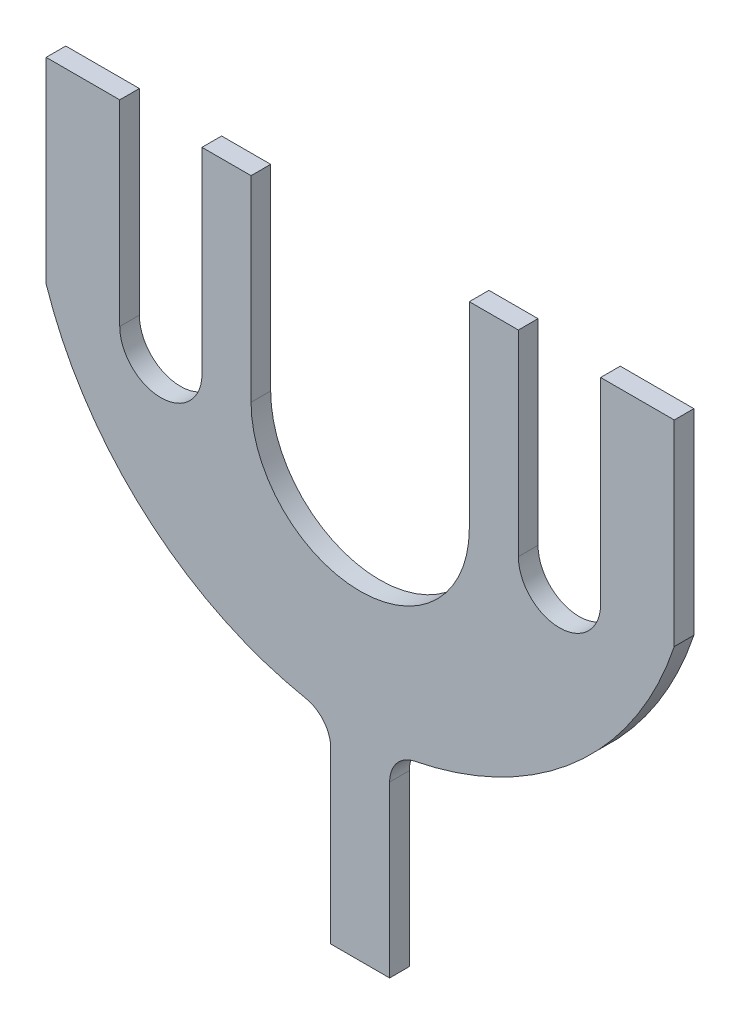
ISO-10303-21;
HEADER;
FILE_DESCRIPTION(('STEP AP214'),'2;1');
FILE_NAME('part.step','',(''),(''),'','','');
FILE_SCHEMA(('AUTOMOTIVE_DESIGN { 1 0 10303 214 1 1 1 1 }'));
ENDSEC;
DATA;
#1=APPLICATION_CONTEXT('core data for automotive mechanical design processes');
#2=APPLICATION_PROTOCOL_DEFINITION('international standard','automotive_design',2000,#1);
#3=PRODUCT_CONTEXT('',#1,'mechanical');
#4=PRODUCT('Part','Part','',(#3));
#5=PRODUCT_RELATED_PRODUCT_CATEGORY('part','',(#4));
#6=PRODUCT_DEFINITION_FORMATION('','',#4);
#7=PRODUCT_DEFINITION_CONTEXT('part definition',#1,'design');
#8=PRODUCT_DEFINITION('design','',#6,#7);
#9=PRODUCT_DEFINITION_SHAPE('','',#8);
#10=(LENGTH_UNIT() NAMED_UNIT(*) SI_UNIT(.MILLI.,.METRE.));
#11=(NAMED_UNIT(*) PLANE_ANGLE_UNIT() SI_UNIT($,.RADIAN.));
#12=(NAMED_UNIT(*) SI_UNIT($,.STERADIAN.) SOLID_ANGLE_UNIT());
#13=UNCERTAINTY_MEASURE_WITH_UNIT(LENGTH_MEASURE(1.E-05),#10,'distance_accuracy_value','');
#14=(GEOMETRIC_REPRESENTATION_CONTEXT(3) GLOBAL_UNCERTAINTY_ASSIGNED_CONTEXT((#13)) GLOBAL_UNIT_ASSIGNED_CONTEXT((#10,
#11,#12)) REPRESENTATION_CONTEXT('',''));
#15=CARTESIAN_POINT('',(0.,0.,0.));
#16=DIRECTION('',(0.,0.,1.));
#17=DIRECTION('',(1.,0.,0.));
#18=AXIS2_PLACEMENT_3D('',#15,#16,#17);
#19=CARTESIAN_POINT('',(-4.99999999999998,11.4877700189129,1.));
#20=DIRECTION('',(0.,0.,-1.));
#21=DIRECTION('',(-1.,0.,0.));
#22=AXIS2_PLACEMENT_3D('',#19,#20,#21);
#23=CYLINDRICAL_SURFACE('',#22,5.56);
#24=CARTESIAN_POINT('',(-4.99999999999998,11.4877700189129,0.));
#25=DIRECTION('',(0.,0.,-1.));
#26=DIRECTION('',(1.,0.,0.));
#27=AXIS2_PLACEMENT_3D('',#24,#25,#26);
#28=CIRCLE('',#27,5.56);
#29=CARTESIAN_POINT('',(0.560000000000015,11.4877700189129,0.));
#30=VERTEX_POINT('',#29);
#31=CARTESIAN_POINT('',(-10.56,11.4877700189129,0.));
#32=VERTEX_POINT('',#31);
#33=EDGE_CURVE('E227',#30,#32,#28,.T.);
#34=ORIENTED_EDGE('',*,*,#33,.T.);
#35=DIRECTION('',(0.,0.,-1.));
#36=VECTOR('',#35,1.);
#37=CARTESIAN_POINT('',(-10.56,11.4877700189129,1.));
#38=LINE('',#37,#36);
#39=CARTESIAN_POINT('',(-10.56,11.4877700189129,1.));
#40=VERTEX_POINT('',#39);
#41=EDGE_CURVE('E11',#40,#32,#38,.T.);
#42=ORIENTED_EDGE('',*,*,#41,.F.);
#43=CARTESIAN_POINT('',(-4.99999999999998,11.4877700189129,1.));
#44=DIRECTION('',(0.,0.,-1.));
#45=DIRECTION('',(1.,0.,0.));
#46=AXIS2_PLACEMENT_3D('',#43,#44,#45);
#47=CIRCLE('',#46,5.56);
#48=CARTESIAN_POINT('',(0.560000000000015,11.4877700189129,1.));
#49=VERTEX_POINT('',#48);
#50=EDGE_CURVE('E290',#49,#40,#47,.T.);
#51=ORIENTED_EDGE('',*,*,#50,.F.);
#52=DIRECTION('',(0.,0.,-1.));
#53=VECTOR('',#52,1.);
#54=CARTESIAN_POINT('',(0.560000000000015,11.4877700189129,1.));
#55=LINE('',#54,#53);
#56=EDGE_CURVE('E223',#49,#30,#55,.T.);
#57=ORIENTED_EDGE('',*,*,#56,.T.);
#58=EDGE_LOOP('',(#34,#42,#51,#57));
#59=FACE_BOUND('',#58,.T.);
#60=ADVANCED_FACE('F40',(#59),#23,.F.);
#61=CARTESIAN_POINT('',(-10.56,21.4877700189129,1.));
#62=DIRECTION('',(-1.,0.,0.));
#63=DIRECTION('',(0.,-1.,0.));
#64=AXIS2_PLACEMENT_3D('',#61,#62,#63);
#65=PLANE('',#64);
#66=DIRECTION('',(0.,1.,0.));
#67=VECTOR('',#66,1.);
#68=CARTESIAN_POINT('',(-10.56,21.4877700189129,0.));
#69=LINE('',#68,#67);
#70=CARTESIAN_POINT('',(-10.56,21.4877700189129,0.));
#71=VERTEX_POINT('',#70);
#72=EDGE_CURVE('E230',#32,#71,#69,.T.);
#73=ORIENTED_EDGE('',*,*,#72,.T.);
#74=DIRECTION('',(0.,0.,-1.));
#75=VECTOR('',#74,1.);
#76=CARTESIAN_POINT('',(-10.56,21.4877700189129,1.));
#77=LINE('',#76,#75);
#78=CARTESIAN_POINT('',(-10.56,21.4877700189129,1.));
#79=VERTEX_POINT('',#78);
#80=EDGE_CURVE('E49',#79,#71,#77,.T.);
#81=ORIENTED_EDGE('',*,*,#80,.F.);
#82=DIRECTION('',(0.,1.,0.));
#83=VECTOR('',#82,1.);
#84=CARTESIAN_POINT('',(-10.56,21.4877700189129,1.));
#85=LINE('',#84,#83);
#86=EDGE_CURVE('E142',#40,#79,#85,.T.);
#87=ORIENTED_EDGE('',*,*,#86,.F.);
#88=ORIENTED_EDGE('',*,*,#41,.T.);
#89=EDGE_LOOP('',(#73,#81,#87,#88));
#90=FACE_BOUND('',#89,.T.);
#91=ADVANCED_FACE('F437',(#90),#65,.F.);
#92=CARTESIAN_POINT('',(-13.06,21.4877700189129,1.));
#93=DIRECTION('',(0.,-1.,0.));
#94=DIRECTION('',(0.,0.,-1.));
#95=AXIS2_PLACEMENT_3D('',#92,#93,#94);
#96=PLANE('',#95);
#97=DIRECTION('',(-1.,0.,0.));
#98=VECTOR('',#97,1.);
#99=CARTESIAN_POINT('',(-13.06,21.4877700189129,0.));
#100=LINE('',#99,#98);
#101=CARTESIAN_POINT('',(-13.06,21.4877700189129,0.));
#102=VERTEX_POINT('',#101);
#103=EDGE_CURVE('E233',#71,#102,#100,.T.);
#104=ORIENTED_EDGE('',*,*,#103,.T.);
#105=DIRECTION('',(0.,0.,-1.));
#106=VECTOR('',#105,1.);
#107=CARTESIAN_POINT('',(-13.06,21.4877700189129,1.));
#108=LINE('',#107,#106);
#109=CARTESIAN_POINT('',(-13.06,21.4877700189129,1.));
#110=VERTEX_POINT('',#109);
#111=EDGE_CURVE('E357',#110,#102,#108,.T.);
#112=ORIENTED_EDGE('',*,*,#111,.F.);
#113=DIRECTION('',(-1.,0.,0.));
#114=VECTOR('',#113,1.);
#115=CARTESIAN_POINT('',(-13.06,21.4877700189129,1.));
#116=LINE('',#115,#114);
#117=EDGE_CURVE('E367',#79,#110,#116,.T.);
#118=ORIENTED_EDGE('',*,*,#117,.F.);
#119=ORIENTED_EDGE('',*,*,#80,.T.);
#120=EDGE_LOOP('',(#104,#112,#118,#119));
#121=FACE_BOUND('',#120,.T.);
#122=ADVANCED_FACE('F365',(#121),#96,.F.);
#123=CARTESIAN_POINT('',(-13.06,11.4877700189129,1.));
#124=DIRECTION('',(1.,0.,0.));
#125=DIRECTION('',(0.,0.,-1.));
#126=AXIS2_PLACEMENT_3D('',#123,#124,#125);
#127=PLANE('',#126);
#128=DIRECTION('',(0.,-1.,0.));
#129=VECTOR('',#128,1.);
#130=CARTESIAN_POINT('',(-13.06,11.4877700189129,0.));
#131=LINE('',#130,#129);
#132=CARTESIAN_POINT('',(-13.06,11.4877700189129,0.));
#133=VERTEX_POINT('',#132);
#134=EDGE_CURVE('E236',#102,#133,#131,.T.);
#135=ORIENTED_EDGE('',*,*,#134,.T.);
#136=DIRECTION('',(0.,0.,-1.));
#137=VECTOR('',#136,1.);
#138=CARTESIAN_POINT('',(-13.06,11.4877700189129,1.));
#139=LINE('',#138,#137);
#140=CARTESIAN_POINT('',(-13.06,11.4877700189129,1.));
#141=VERTEX_POINT('',#140);
#142=EDGE_CURVE('E353',#141,#133,#139,.T.);
#143=ORIENTED_EDGE('',*,*,#142,.F.);
#144=DIRECTION('',(0.,-1.,0.));
#145=VECTOR('',#144,1.);
#146=CARTESIAN_POINT('',(-13.06,11.4877700189129,1.));
#147=LINE('',#146,#145);
#148=EDGE_CURVE('E386',#110,#141,#147,.T.);
#149=ORIENTED_EDGE('',*,*,#148,.F.);
#150=ORIENTED_EDGE('',*,*,#111,.T.);
#151=EDGE_LOOP('',(#135,#143,#149,#150));
#152=FACE_BOUND('',#151,.T.);
#153=ADVANCED_FACE('F376',(#152),#127,.F.);
#154=CARTESIAN_POINT('',(-15.155,11.4877700189129,1.));
#155=DIRECTION('',(0.,0.,-1.));
#156=DIRECTION('',(-1.,0.,0.));
#157=AXIS2_PLACEMENT_3D('',#154,#155,#156);
#158=CYLINDRICAL_SURFACE('',#157,2.095);
#159=CARTESIAN_POINT('',(-15.155,11.4877700189129,0.));
#160=DIRECTION('',(0.,0.,-1.));
#161=DIRECTION('',(1.,0.,0.));
#162=AXIS2_PLACEMENT_3D('',#159,#160,#161);
#163=CIRCLE('',#162,2.095);
#164=CARTESIAN_POINT('',(-17.25,11.4877700189129,0.));
#165=VERTEX_POINT('',#164);
#166=EDGE_CURVE('E239',#133,#165,#163,.T.);
#167=ORIENTED_EDGE('',*,*,#166,.T.);
#168=DIRECTION('',(0.,0.,-1.));
#169=VECTOR('',#168,1.);
#170=CARTESIAN_POINT('',(-17.25,11.4877700189129,1.));
#171=LINE('',#170,#169);
#172=CARTESIAN_POINT('',(-17.25,11.4877700189129,1.));
#173=VERTEX_POINT('',#172);
#174=EDGE_CURVE('E349',#173,#165,#171,.T.);
#175=ORIENTED_EDGE('',*,*,#174,.F.);
#176=CARTESIAN_POINT('',(-15.155,11.4877700189129,1.));
#177=DIRECTION('',(0.,0.,-1.));
#178=DIRECTION('',(1.,0.,0.));
#179=AXIS2_PLACEMENT_3D('',#176,#177,#178);
#180=CIRCLE('',#179,2.095);
#181=EDGE_CURVE('E382',#141,#173,#180,.T.);
#182=ORIENTED_EDGE('',*,*,#181,.F.);
#183=ORIENTED_EDGE('',*,*,#142,.T.);
#184=EDGE_LOOP('',(#167,#175,#182,#183));
#185=FACE_BOUND('',#184,.T.);
#186=ADVANCED_FACE('F380',(#185),#158,.F.);
#187=CARTESIAN_POINT('',(-17.25,11.4877700189129,1.));
#188=DIRECTION('',(-1.,0.,0.));
#189=DIRECTION('',(0.,0.,1.));
#190=AXIS2_PLACEMENT_3D('',#187,#188,#189);
#191=PLANE('',#190);
#192=DIRECTION('',(0.,1.,0.));
#193=VECTOR('',#192,1.);
#194=CARTESIAN_POINT('',(-17.25,11.4877700189129,0.));
#195=LINE('',#194,#193);
#196=CARTESIAN_POINT('',(-17.25,21.4877700189129,0.));
#197=VERTEX_POINT('',#196);
#198=EDGE_CURVE('E242',#165,#197,#195,.T.);
#199=ORIENTED_EDGE('',*,*,#198,.T.);
#200=DIRECTION('',(0.,0.,-1.));
#201=VECTOR('',#200,1.);
#202=CARTESIAN_POINT('',(-17.25,21.4877700189129,1.));
#203=LINE('',#202,#201);
#204=CARTESIAN_POINT('',(-17.25,21.4877700189129,1.));
#205=VERTEX_POINT('',#204);
#206=EDGE_CURVE('E345',#205,#197,#203,.T.);
#207=ORIENTED_EDGE('',*,*,#206,.F.);
#208=DIRECTION('',(0.,1.,0.));
#209=VECTOR('',#208,1.);
#210=CARTESIAN_POINT('',(-17.25,11.4877700189129,1.));
#211=LINE('',#210,#209);
#212=EDGE_CURVE('E385',#173,#205,#211,.T.);
#213=ORIENTED_EDGE('',*,*,#212,.F.);
#214=ORIENTED_EDGE('',*,*,#174,.T.);
#215=EDGE_LOOP('',(#199,#207,#213,#214));
#216=FACE_BOUND('',#215,.T.);
#217=ADVANCED_FACE('F449',(#216),#191,.F.);
#218=CARTESIAN_POINT('',(-21.,21.4877700189129,1.));
#219=DIRECTION('',(0.,-1.,0.));
#220=DIRECTION('',(1.,0.,0.));
#221=AXIS2_PLACEMENT_3D('',#218,#219,#220);
#222=PLANE('',#221);
#223=DIRECTION('',(-1.,0.,0.));
#224=VECTOR('',#223,1.);
#225=CARTESIAN_POINT('',(-21.,21.4877700189129,0.));
#226=LINE('',#225,#224);
#227=CARTESIAN_POINT('',(-21.,21.4877700189129,0.));
#228=VERTEX_POINT('',#227);
#229=EDGE_CURVE('E245',#197,#228,#226,.T.);
#230=ORIENTED_EDGE('',*,*,#229,.T.);
#231=DIRECTION('',(0.,0.,-1.));
#232=VECTOR('',#231,1.);
#233=CARTESIAN_POINT('',(-21.,21.4877700189129,1.));
#234=LINE('',#233,#232);
#235=CARTESIAN_POINT('',(-21.,21.4877700189129,1.));
#236=VERTEX_POINT('',#235);
#237=EDGE_CURVE('E341',#236,#228,#234,.T.);
#238=ORIENTED_EDGE('',*,*,#237,.F.);
#239=DIRECTION('',(-1.,0.,0.));
#240=VECTOR('',#239,1.);
#241=CARTESIAN_POINT('',(-21.,21.4877700189129,1.));
#242=LINE('',#241,#240);
#243=EDGE_CURVE('E389',#205,#236,#242,.T.);
#244=ORIENTED_EDGE('',*,*,#243,.F.);
#245=ORIENTED_EDGE('',*,*,#206,.T.);
#246=EDGE_LOOP('',(#230,#238,#244,#245));
#247=FACE_BOUND('',#246,.T.);
#248=ADVANCED_FACE('F452',(#247),#222,.F.);
#249=CARTESIAN_POINT('',(-21.,21.4877700189129,1.));
#250=DIRECTION('',(1.,0.,0.));
#251=DIRECTION('',(0.,0.,-1.));
#252=AXIS2_PLACEMENT_3D('',#249,#250,#251);
#253=PLANE('',#252);
#254=DIRECTION('',(0.,-1.,0.));
#255=VECTOR('',#254,1.);
#256=CARTESIAN_POINT('',(-21.,21.4877700189129,0.));
#257=LINE('',#256,#255);
#258=CARTESIAN_POINT('',(-21.,11.4877700189129,0.));
#259=VERTEX_POINT('',#258);
#260=EDGE_CURVE('E248',#228,#259,#257,.T.);
#261=ORIENTED_EDGE('',*,*,#260,.T.);
#262=DIRECTION('',(0.,0.,-1.));
#263=VECTOR('',#262,1.);
#264=CARTESIAN_POINT('',(-21.,11.4877700189129,1.));
#265=LINE('',#264,#263);
#266=CARTESIAN_POINT('',(-21.,11.4877700189129,1.));
#267=VERTEX_POINT('',#266);
#268=EDGE_CURVE('E337',#267,#259,#265,.T.);
#269=ORIENTED_EDGE('',*,*,#268,.F.);
#270=DIRECTION('',(0.,-1.,0.));
#271=VECTOR('',#270,1.);
#272=CARTESIAN_POINT('',(-21.,21.4877700189129,1.));
#273=LINE('',#272,#271);
#274=EDGE_CURVE('E396',#236,#267,#273,.T.);
#275=ORIENTED_EDGE('',*,*,#274,.F.);
#276=ORIENTED_EDGE('',*,*,#237,.T.);
#277=EDGE_LOOP('',(#261,#269,#275,#276));
#278=FACE_BOUND('',#277,.T.);
#279=ADVANCED_FACE('F456',(#278),#253,.F.);
#280=CARTESIAN_POINT('',(-4.38675227416383,16.9877700189129,1.));
#281=DIRECTION('',(0.,0.,-1.));
#282=DIRECTION('',(-1.,0.,0.));
#283=AXIS2_PLACEMENT_3D('',#280,#281,#282);
#284=CYLINDRICAL_SURFACE('',#283,17.5);
#285=CARTESIAN_POINT('',(-4.38675227416383,16.9877700189129,0.));
#286=DIRECTION('',(0.,0.,1.));
#287=DIRECTION('',(1.,0.,0.));
#288=AXIS2_PLACEMENT_3D('',#285,#286,#287);
#289=CIRCLE('',#288,17.5);
#290=CARTESIAN_POINT('',(-7.77971024153162,-0.18016043969734,0.));
#291=VERTEX_POINT('',#290);
#292=EDGE_CURVE('E251',#259,#291,#289,.T.);
#293=ORIENTED_EDGE('',*,*,#292,.T.);
#294=DIRECTION('',(0.,0.,-1.));
#295=VECTOR('',#294,1.);
#296=CARTESIAN_POINT('',(-7.77971024153162,-0.18016043969734,1.));
#297=LINE('',#296,#295);
#298=CARTESIAN_POINT('',(-7.77971024153162,-0.18016043969734,1.));
#299=VERTEX_POINT('',#298);
#300=EDGE_CURVE('E333',#299,#291,#297,.T.);
#301=ORIENTED_EDGE('',*,*,#300,.F.);
#302=CARTESIAN_POINT('',(-4.38675227416383,16.9877700189129,1.));
#303=DIRECTION('',(0.,0.,1.));
#304=DIRECTION('',(1.,0.,0.));
#305=AXIS2_PLACEMENT_3D('',#302,#303,#304);
#306=CIRCLE('',#305,17.5);
#307=EDGE_CURVE('E399',#267,#299,#306,.T.);
#308=ORIENTED_EDGE('',*,*,#307,.F.);
#309=ORIENTED_EDGE('',*,*,#268,.T.);
#310=EDGE_LOOP('',(#293,#301,#308,#309));
#311=FACE_BOUND('',#310,.T.);
#312=ADVANCED_FACE('F460',(#311),#284,.T.);
#313=CARTESIAN_POINT('',(-8.08749999999998,-1.73753698844269,1.));
#314=DIRECTION('',(0.,0.,-1.));
#315=DIRECTION('',(-1.,0.,0.));
#316=AXIS2_PLACEMENT_3D('',#313,#314,#315);
#317=CYLINDRICAL_SURFACE('',#316,1.5875);
#318=CARTESIAN_POINT('',(-8.08749999999998,-1.73753698844269,0.));
#319=DIRECTION('',(0.,0.,-1.));
#320=DIRECTION('',(-1.,0.,0.));
#321=AXIS2_PLACEMENT_3D('',#318,#319,#320);
#322=CIRCLE('',#321,1.5875);
#323=CARTESIAN_POINT('',(-6.49999999999998,-1.73753698844269,0.));
#324=VERTEX_POINT('',#323);
#325=EDGE_CURVE('E254',#291,#324,#322,.T.);
#326=ORIENTED_EDGE('',*,*,#325,.T.);
#327=DIRECTION('',(0.,0.,-1.));
#328=VECTOR('',#327,1.);
#329=CARTESIAN_POINT('',(-6.49999999999998,-1.73753698844269,1.));
#330=LINE('',#329,#328);
#331=CARTESIAN_POINT('',(-6.49999999999998,-1.73753698844269,1.));
#332=VERTEX_POINT('',#331);
#333=EDGE_CURVE('E329',#332,#324,#330,.T.);
#334=ORIENTED_EDGE('',*,*,#333,.F.);
#335=CARTESIAN_POINT('',(-8.08749999999998,-1.73753698844269,1.));
#336=DIRECTION('',(0.,0.,-1.));
#337=DIRECTION('',(-1.,0.,0.));
#338=AXIS2_PLACEMENT_3D('',#335,#336,#337);
#339=CIRCLE('',#338,1.5875);
#340=EDGE_CURVE('E402',#299,#332,#339,.T.);
#341=ORIENTED_EDGE('',*,*,#340,.F.);
#342=ORIENTED_EDGE('',*,*,#300,.T.);
#343=EDGE_LOOP('',(#326,#334,#341,#342));
#344=FACE_BOUND('',#343,.T.);
#345=ADVANCED_FACE('F464',(#344),#317,.F.);
#346=CARTESIAN_POINT('',(-6.49999999999998,-1.73753698844269,1.));
#347=DIRECTION('',(1.,0.,0.));
#348=DIRECTION('',(0.,1.,0.));
#349=AXIS2_PLACEMENT_3D('',#346,#347,#348);
#350=PLANE('',#349);
#351=DIRECTION('',(0.,-1.,0.));
#352=VECTOR('',#351,1.);
#353=CARTESIAN_POINT('',(-6.49999999999998,-1.73753698844269,0.));
#354=LINE('',#353,#352);
#355=CARTESIAN_POINT('',(-6.49999999999998,-10.3841666621037,0.));
#356=VERTEX_POINT('',#355);
#357=EDGE_CURVE('E257',#324,#356,#354,.T.);
#358=ORIENTED_EDGE('',*,*,#357,.T.);
#359=DIRECTION('',(0.,0.,-1.));
#360=VECTOR('',#359,1.);
#361=CARTESIAN_POINT('',(-6.49999999999998,-10.3841666621037,1.));
#362=LINE('',#361,#360);
#363=CARTESIAN_POINT('',(-6.49999999999998,-10.3841666621037,1.));
#364=VERTEX_POINT('',#363);
#365=EDGE_CURVE('E325',#364,#356,#362,.T.);
#366=ORIENTED_EDGE('',*,*,#365,.F.);
#367=DIRECTION('',(0.,-1.,0.));
#368=VECTOR('',#367,1.);
#369=CARTESIAN_POINT('',(-6.49999999999998,-1.73753698844269,1.));
#370=LINE('',#369,#368);
#371=EDGE_CURVE('E405',#332,#364,#370,.T.);
#372=ORIENTED_EDGE('',*,*,#371,.F.);
#373=ORIENTED_EDGE('',*,*,#333,.T.);
#374=EDGE_LOOP('',(#358,#366,#372,#373));
#375=FACE_BOUND('',#374,.T.);
#376=ADVANCED_FACE('F468',(#375),#350,.F.);
#377=CARTESIAN_POINT('',(-6.49999999999998,-10.3841666621037,1.));
#378=DIRECTION('',(0.,1.,0.));
#379=DIRECTION('',(0.,0.,1.));
#380=AXIS2_PLACEMENT_3D('',#377,#378,#379);
#381=PLANE('',#380);
#382=DIRECTION('',(1.,0.,0.));
#383=VECTOR('',#382,1.);
#384=CARTESIAN_POINT('',(-6.49999999999998,-10.3841666621037,0.));
#385=LINE('',#384,#383);
#386=CARTESIAN_POINT('',(-3.49999999999998,-10.3841666621037,0.));
#387=VERTEX_POINT('',#386);
#388=EDGE_CURVE('E260',#356,#387,#385,.T.);
#389=ORIENTED_EDGE('',*,*,#388,.T.);
#390=DIRECTION('',(0.,0.,-1.));
#391=VECTOR('',#390,1.);
#392=CARTESIAN_POINT('',(-3.49999999999998,-10.3841666621037,1.));
#393=LINE('',#392,#391);
#394=CARTESIAN_POINT('',(-3.49999999999998,-10.3841666621037,1.));
#395=VERTEX_POINT('',#394);
#396=EDGE_CURVE('E321',#395,#387,#393,.T.);
#397=ORIENTED_EDGE('',*,*,#396,.F.);
#398=DIRECTION('',(1.,0.,0.));
#399=VECTOR('',#398,1.);
#400=CARTESIAN_POINT('',(-6.49999999999998,-10.3841666621037,1.));
#401=LINE('',#400,#399);
#402=EDGE_CURVE('E408',#364,#395,#401,.T.);
#403=ORIENTED_EDGE('',*,*,#402,.F.);
#404=ORIENTED_EDGE('',*,*,#365,.T.);
#405=EDGE_LOOP('',(#389,#397,#403,#404));
#406=FACE_BOUND('',#405,.T.);
#407=ADVANCED_FACE('F472',(#406),#381,.F.);
#408=CARTESIAN_POINT('',(-3.49999999999998,-10.3841666621037,1.));
#409=DIRECTION('',(-1.,0.,0.));
#410=DIRECTION('',(0.,-1.,0.));
#411=AXIS2_PLACEMENT_3D('',#408,#409,#410);
#412=PLANE('',#411);
#413=DIRECTION('',(0.,1.,0.));
#414=VECTOR('',#413,1.);
#415=CARTESIAN_POINT('',(-3.49999999999998,-10.3841666621037,0.));
#416=LINE('',#415,#414);
#417=CARTESIAN_POINT('',(-3.49999999999998,-1.73753698844269,0.));
#418=VERTEX_POINT('',#417);
#419=EDGE_CURVE('E263',#387,#418,#416,.T.);
#420=ORIENTED_EDGE('',*,*,#419,.T.);
#421=DIRECTION('',(0.,0.,-1.));
#422=VECTOR('',#421,1.);
#423=CARTESIAN_POINT('',(-3.49999999999998,-1.73753698844269,1.));
#424=LINE('',#423,#422);
#425=CARTESIAN_POINT('',(-3.49999999999998,-1.73753698844269,1.));
#426=VERTEX_POINT('',#425);
#427=EDGE_CURVE('E317',#426,#418,#424,.T.);
#428=ORIENTED_EDGE('',*,*,#427,.F.);
#429=DIRECTION('',(0.,1.,0.));
#430=VECTOR('',#429,1.);
#431=CARTESIAN_POINT('',(-3.49999999999998,-10.3841666621037,1.));
#432=LINE('',#431,#430);
#433=EDGE_CURVE('E411',#395,#426,#432,.T.);
#434=ORIENTED_EDGE('',*,*,#433,.F.);
#435=ORIENTED_EDGE('',*,*,#396,.T.);
#436=EDGE_LOOP('',(#420,#428,#434,#435));
#437=FACE_BOUND('',#436,.T.);
#438=ADVANCED_FACE('F476',(#437),#412,.F.);
#439=CARTESIAN_POINT('',(-1.91249999999998,-1.73753698844269,1.));
#440=DIRECTION('',(0.,0.,-1.));
#441=DIRECTION('',(-1.,0.,0.));
#442=AXIS2_PLACEMENT_3D('',#439,#440,#441);
#443=CYLINDRICAL_SURFACE('',#442,1.5875);
#444=CARTESIAN_POINT('',(-1.91249999999998,-1.73753698844269,0.));
#445=DIRECTION('',(0.,0.,-1.));
#446=DIRECTION('',(1.,0.,0.));
#447=AXIS2_PLACEMENT_3D('',#444,#445,#446);
#448=CIRCLE('',#447,1.5875);
#449=CARTESIAN_POINT('',(-2.22028975846834,-0.180160439697338,0.));
#450=VERTEX_POINT('',#449);
#451=EDGE_CURVE('E266',#418,#450,#448,.T.);
#452=ORIENTED_EDGE('',*,*,#451,.T.);
#453=DIRECTION('',(0.,0.,-1.));
#454=VECTOR('',#453,1.);
#455=CARTESIAN_POINT('',(-2.22028975846834,-0.180160439697338,1.));
#456=LINE('',#455,#454);
#457=CARTESIAN_POINT('',(-2.22028975846834,-0.180160439697338,1.));
#458=VERTEX_POINT('',#457);
#459=EDGE_CURVE('E313',#458,#450,#456,.T.);
#460=ORIENTED_EDGE('',*,*,#459,.F.);
#461=CARTESIAN_POINT('',(-1.91249999999998,-1.73753698844269,1.));
#462=DIRECTION('',(0.,0.,-1.));
#463=DIRECTION('',(1.,0.,0.));
#464=AXIS2_PLACEMENT_3D('',#461,#462,#463);
#465=CIRCLE('',#464,1.5875);
#466=EDGE_CURVE('E414',#426,#458,#465,.T.);
#467=ORIENTED_EDGE('',*,*,#466,.F.);
#468=ORIENTED_EDGE('',*,*,#427,.T.);
#469=EDGE_LOOP('',(#452,#460,#467,#468));
#470=FACE_BOUND('',#469,.T.);
#471=ADVANCED_FACE('F480',(#470),#443,.F.);
#472=CARTESIAN_POINT('',(-5.61324772583614,16.9877700189129,1.));
#473=DIRECTION('',(0.,0.,-1.));
#474=DIRECTION('',(-1.,0.,0.));
#475=AXIS2_PLACEMENT_3D('',#472,#473,#474);
#476=CYLINDRICAL_SURFACE('',#475,17.5);
#477=CARTESIAN_POINT('',(-5.61324772583614,16.9877700189129,0.));
#478=DIRECTION('',(0.,0.,1.));
#479=DIRECTION('',(-1.,0.,0.));
#480=AXIS2_PLACEMENT_3D('',#477,#478,#479);
#481=CIRCLE('',#480,17.5);
#482=CARTESIAN_POINT('',(11.,11.4877700189129,0.));
#483=VERTEX_POINT('',#482);
#484=EDGE_CURVE('E269',#450,#483,#481,.T.);
#485=ORIENTED_EDGE('',*,*,#484,.T.);
#486=DIRECTION('',(0.,0.,-1.));
#487=VECTOR('',#486,1.);
#488=CARTESIAN_POINT('',(11.,11.4877700189129,1.));
#489=LINE('',#488,#487);
#490=CARTESIAN_POINT('',(11.,11.4877700189129,1.));
#491=VERTEX_POINT('',#490);
#492=EDGE_CURVE('E309',#491,#483,#489,.T.);
#493=ORIENTED_EDGE('',*,*,#492,.F.);
#494=CARTESIAN_POINT('',(-5.61324772583614,16.9877700189129,1.));
#495=DIRECTION('',(0.,0.,1.));
#496=DIRECTION('',(-1.,0.,0.));
#497=AXIS2_PLACEMENT_3D('',#494,#495,#496);
#498=CIRCLE('',#497,17.5);
#499=EDGE_CURVE('E417',#458,#491,#498,.T.);
#500=ORIENTED_EDGE('',*,*,#499,.F.);
#501=ORIENTED_EDGE('',*,*,#459,.T.);
#502=EDGE_LOOP('',(#485,#493,#500,#501));
#503=FACE_BOUND('',#502,.T.);
#504=ADVANCED_FACE('F484',(#503),#476,.T.);
#505=CARTESIAN_POINT('',(11.,11.4877700189129,1.));
#506=DIRECTION('',(-1.,0.,0.));
#507=DIRECTION('',(0.,-1.,0.));
#508=AXIS2_PLACEMENT_3D('',#505,#506,#507);
#509=PLANE('',#508);
#510=DIRECTION('',(0.,1.,0.));
#511=VECTOR('',#510,1.);
#512=CARTESIAN_POINT('',(11.,11.4877700189129,0.));
#513=LINE('',#512,#511);
#514=CARTESIAN_POINT('',(11.,21.4877700189129,0.));
#515=VERTEX_POINT('',#514);
#516=EDGE_CURVE('E272',#483,#515,#513,.T.);
#517=ORIENTED_EDGE('',*,*,#516,.T.);
#518=DIRECTION('',(0.,0.,-1.));
#519=VECTOR('',#518,1.);
#520=CARTESIAN_POINT('',(11.,21.4877700189129,1.));
#521=LINE('',#520,#519);
#522=CARTESIAN_POINT('',(11.,21.4877700189129,1.));
#523=VERTEX_POINT('',#522);
#524=EDGE_CURVE('E305',#523,#515,#521,.T.);
#525=ORIENTED_EDGE('',*,*,#524,.F.);
#526=DIRECTION('',(0.,1.,0.));
#527=VECTOR('',#526,1.);
#528=CARTESIAN_POINT('',(11.,11.4877700189129,1.));
#529=LINE('',#528,#527);
#530=EDGE_CURVE('E420',#491,#523,#529,.T.);
#531=ORIENTED_EDGE('',*,*,#530,.F.);
#532=ORIENTED_EDGE('',*,*,#492,.T.);
#533=EDGE_LOOP('',(#517,#525,#531,#532));
#534=FACE_BOUND('',#533,.T.);
#535=ADVANCED_FACE('F488',(#534),#509,.F.);
#536=CARTESIAN_POINT('',(7.25000000000002,21.4877700189129,1.));
#537=DIRECTION('',(0.,-1.,0.));
#538=DIRECTION('',(0.,0.,-1.));
#539=AXIS2_PLACEMENT_3D('',#536,#537,#538);
#540=PLANE('',#539);
#541=DIRECTION('',(-1.,0.,0.));
#542=VECTOR('',#541,1.);
#543=CARTESIAN_POINT('',(7.25000000000002,21.4877700189129,0.));
#544=LINE('',#543,#542);
#545=CARTESIAN_POINT('',(7.25000000000002,21.4877700189129,0.));
#546=VERTEX_POINT('',#545);
#547=EDGE_CURVE('E275',#515,#546,#544,.T.);
#548=ORIENTED_EDGE('',*,*,#547,.T.);
#549=DIRECTION('',(0.,0.,-1.));
#550=VECTOR('',#549,1.);
#551=CARTESIAN_POINT('',(7.25000000000002,21.4877700189129,1.));
#552=LINE('',#551,#550);
#553=CARTESIAN_POINT('',(7.25000000000002,21.4877700189129,1.));
#554=VERTEX_POINT('',#553);
#555=EDGE_CURVE('E301',#554,#546,#552,.T.);
#556=ORIENTED_EDGE('',*,*,#555,.F.);
#557=DIRECTION('',(-1.,0.,0.));
#558=VECTOR('',#557,1.);
#559=CARTESIAN_POINT('',(7.25000000000002,21.4877700189129,1.));
#560=LINE('',#559,#558);
#561=EDGE_CURVE('E423',#523,#554,#560,.T.);
#562=ORIENTED_EDGE('',*,*,#561,.F.);
#563=ORIENTED_EDGE('',*,*,#524,.T.);
#564=EDGE_LOOP('',(#548,#556,#562,#563));
#565=FACE_BOUND('',#564,.T.);
#566=ADVANCED_FACE('F492',(#565),#540,.F.);
#567=CARTESIAN_POINT('',(7.25000000000002,11.4877700189129,1.));
#568=DIRECTION('',(1.,0.,0.));
#569=DIRECTION('',(0.,0.,-1.));
#570=AXIS2_PLACEMENT_3D('',#567,#568,#569);
#571=PLANE('',#570);
#572=DIRECTION('',(0.,-1.,0.));
#573=VECTOR('',#572,1.);
#574=CARTESIAN_POINT('',(7.25000000000002,11.4877700189129,0.));
#575=LINE('',#574,#573);
#576=CARTESIAN_POINT('',(7.25000000000002,11.4877700189129,0.));
#577=VERTEX_POINT('',#576);
#578=EDGE_CURVE('E278',#546,#577,#575,.T.);
#579=ORIENTED_EDGE('',*,*,#578,.T.);
#580=DIRECTION('',(0.,0.,-1.));
#581=VECTOR('',#580,1.);
#582=CARTESIAN_POINT('',(7.25000000000002,11.4877700189129,1.));
#583=LINE('',#582,#581);
#584=CARTESIAN_POINT('',(7.25000000000002,11.4877700189129,1.));
#585=VERTEX_POINT('',#584);
#586=EDGE_CURVE('E297',#585,#577,#583,.T.);
#587=ORIENTED_EDGE('',*,*,#586,.F.);
#588=DIRECTION('',(0.,-1.,0.));
#589=VECTOR('',#588,1.);
#590=CARTESIAN_POINT('',(7.25000000000002,11.4877700189129,1.));
#591=LINE('',#590,#589);
#592=EDGE_CURVE('E426',#554,#585,#591,.T.);
#593=ORIENTED_EDGE('',*,*,#592,.F.);
#594=ORIENTED_EDGE('',*,*,#555,.T.);
#595=EDGE_LOOP('',(#579,#587,#593,#594));
#596=FACE_BOUND('',#595,.T.);
#597=ADVANCED_FACE('F496',(#596),#571,.F.);
#598=CARTESIAN_POINT('',(5.15500000000002,11.4877700189129,1.));
#599=DIRECTION('',(0.,0.,-1.));
#600=DIRECTION('',(-1.,0.,0.));
#601=AXIS2_PLACEMENT_3D('',#598,#599,#600);
#602=CYLINDRICAL_SURFACE('',#601,2.095);
#603=CARTESIAN_POINT('',(5.15500000000002,11.4877700189129,0.));
#604=DIRECTION('',(0.,0.,-1.));
#605=DIRECTION('',(1.,0.,0.));
#606=AXIS2_PLACEMENT_3D('',#603,#604,#605);
#607=CIRCLE('',#606,2.095);
#608=CARTESIAN_POINT('',(3.06000000000002,11.4877700189129,0.));
#609=VERTEX_POINT('',#608);
#610=EDGE_CURVE('E281',#577,#609,#607,.T.);
#611=ORIENTED_EDGE('',*,*,#610,.T.);
#612=DIRECTION('',(0.,0.,-1.));
#613=VECTOR('',#612,1.);
#614=CARTESIAN_POINT('',(3.06000000000002,11.4877700189129,1.));
#615=LINE('',#614,#613);
#616=CARTESIAN_POINT('',(3.06000000000002,11.4877700189129,1.));
#617=VERTEX_POINT('',#616);
#618=EDGE_CURVE('E214',#617,#609,#615,.T.);
#619=ORIENTED_EDGE('',*,*,#618,.F.);
#620=CARTESIAN_POINT('',(5.15500000000002,11.4877700189129,1.));
#621=DIRECTION('',(0.,0.,-1.));
#622=DIRECTION('',(1.,0.,0.));
#623=AXIS2_PLACEMENT_3D('',#620,#621,#622);
#624=CIRCLE('',#623,2.095);
#625=EDGE_CURVE('E203',#585,#617,#624,.T.);
#626=ORIENTED_EDGE('',*,*,#625,.F.);
#627=ORIENTED_EDGE('',*,*,#586,.T.);
#628=EDGE_LOOP('',(#611,#619,#626,#627));
#629=FACE_BOUND('',#628,.T.);
#630=ADVANCED_FACE('F500',(#629),#602,.F.);
#631=CARTESIAN_POINT('',(3.06000000000001,21.4877700189129,1.));
#632=DIRECTION('',(-1.,0.,0.));
#633=DIRECTION('',(0.,-1.,0.));
#634=AXIS2_PLACEMENT_3D('',#631,#632,#633);
#635=PLANE('',#634);
#636=DIRECTION('',(0.,1.,0.));
#637=VECTOR('',#636,1.);
#638=CARTESIAN_POINT('',(3.06000000000001,21.4877700189129,0.));
#639=LINE('',#638,#637);
#640=CARTESIAN_POINT('',(3.06000000000001,21.4877700189129,0.));
#641=VERTEX_POINT('',#640);
#642=EDGE_CURVE('E212',#609,#641,#639,.T.);
#643=ORIENTED_EDGE('',*,*,#642,.T.);
#644=DIRECTION('',(0.,0.,-1.));
#645=VECTOR('',#644,1.);
#646=CARTESIAN_POINT('',(3.06000000000001,21.4877700189129,1.));
#647=LINE('',#646,#645);
#648=CARTESIAN_POINT('',(3.06000000000001,21.4877700189129,1.));
#649=VERTEX_POINT('',#648);
#650=EDGE_CURVE('E209',#649,#641,#647,.T.);
#651=ORIENTED_EDGE('',*,*,#650,.F.);
#652=DIRECTION('',(0.,1.,0.));
#653=VECTOR('',#652,1.);
#654=CARTESIAN_POINT('',(3.06000000000001,21.4877700189129,1.));
#655=LINE('',#654,#653);
#656=EDGE_CURVE('E197',#617,#649,#655,.T.);
#657=ORIENTED_EDGE('',*,*,#656,.F.);
#658=ORIENTED_EDGE('',*,*,#618,.T.);
#659=EDGE_LOOP('',(#643,#651,#657,#658));
#660=FACE_BOUND('',#659,.T.);
#661=ADVANCED_FACE('F210',(#660),#635,.F.);
#662=CARTESIAN_POINT('',(3.06000000000001,21.4877700189129,1.));
#663=DIRECTION('',(0.,-1.,0.));
#664=DIRECTION('',(0.,0.,-1.));
#665=AXIS2_PLACEMENT_3D('',#662,#663,#664);
#666=PLANE('',#665);
#667=DIRECTION('',(-1.,0.,0.));
#668=VECTOR('',#667,1.);
#669=CARTESIAN_POINT('',(3.06000000000001,21.4877700189129,0.));
#670=LINE('',#669,#668);
#671=CARTESIAN_POINT('',(0.560000000000014,21.4877700189129,0.));
#672=VERTEX_POINT('',#671);
#673=EDGE_CURVE('E128',#641,#672,#670,.T.);
#674=ORIENTED_EDGE('',*,*,#673,.T.);
#675=DIRECTION('',(0.,0.,-1.));
#676=VECTOR('',#675,1.);
#677=CARTESIAN_POINT('',(0.560000000000014,21.4877700189129,1.));
#678=LINE('',#677,#676);
#679=CARTESIAN_POINT('',(0.560000000000014,21.4877700189129,1.));
#680=VERTEX_POINT('',#679);
#681=EDGE_CURVE('E215',#680,#672,#678,.T.);
#682=ORIENTED_EDGE('',*,*,#681,.F.);
#683=DIRECTION('',(-1.,0.,0.));
#684=VECTOR('',#683,1.);
#685=CARTESIAN_POINT('',(3.06000000000001,21.4877700189129,1.));
#686=LINE('',#685,#684);
#687=EDGE_CURVE('E201',#649,#680,#686,.T.);
#688=ORIENTED_EDGE('',*,*,#687,.F.);
#689=ORIENTED_EDGE('',*,*,#650,.T.);
#690=EDGE_LOOP('',(#674,#682,#688,#689));
#691=FACE_BOUND('',#690,.T.);
#692=ADVANCED_FACE('F217',(#691),#666,.F.);
#693=CARTESIAN_POINT('',(0.560000000000014,21.4877700189129,1.));
#694=DIRECTION('',(1.,0.,0.));
#695=DIRECTION('',(0.,1.,0.));
#696=AXIS2_PLACEMENT_3D('',#693,#694,#695);
#697=PLANE('',#696);
#698=DIRECTION('',(0.,-1.,0.));
#699=VECTOR('',#698,1.);
#700=CARTESIAN_POINT('',(0.560000000000014,21.4877700189129,0.));
#701=LINE('',#700,#699);
#702=EDGE_CURVE('E134',#672,#30,#701,.T.);
#703=ORIENTED_EDGE('',*,*,#702,.T.);
#704=ORIENTED_EDGE('',*,*,#56,.F.);
#705=DIRECTION('',(0.,-1.,0.));
#706=VECTOR('',#705,1.);
#707=CARTESIAN_POINT('',(0.560000000000014,21.4877700189129,1.));
#708=LINE('',#707,#706);
#709=EDGE_CURVE('E57',#680,#49,#708,.T.);
#710=ORIENTED_EDGE('',*,*,#709,.F.);
#711=ORIENTED_EDGE('',*,*,#681,.T.);
#712=EDGE_LOOP('',(#703,#704,#710,#711));
#713=FACE_BOUND('',#712,.T.);
#714=ADVANCED_FACE('F509',(#713),#697,.F.);
#715=CARTESIAN_POINT('',(-4.99999999999998,11.4877700189129,1.));
#716=DIRECTION('',(0.,0.,1.));
#717=DIRECTION('',(1.,0.,0.));
#718=AXIS2_PLACEMENT_3D('',#715,#716,#717);
#719=PLANE('',#718);
#720=ORIENTED_EDGE('',*,*,#50,.T.);
#721=ORIENTED_EDGE('',*,*,#86,.T.);
#722=ORIENTED_EDGE('',*,*,#117,.T.);
#723=ORIENTED_EDGE('',*,*,#148,.T.);
#724=ORIENTED_EDGE('',*,*,#181,.T.);
#725=ORIENTED_EDGE('',*,*,#212,.T.);
#726=ORIENTED_EDGE('',*,*,#243,.T.);
#727=ORIENTED_EDGE('',*,*,#274,.T.);
#728=ORIENTED_EDGE('',*,*,#307,.T.);
#729=ORIENTED_EDGE('',*,*,#340,.T.);
#730=ORIENTED_EDGE('',*,*,#371,.T.);
#731=ORIENTED_EDGE('',*,*,#402,.T.);
#732=ORIENTED_EDGE('',*,*,#433,.T.);
#733=ORIENTED_EDGE('',*,*,#466,.T.);
#734=ORIENTED_EDGE('',*,*,#499,.T.);
#735=ORIENTED_EDGE('',*,*,#530,.T.);
#736=ORIENTED_EDGE('',*,*,#561,.T.);
#737=ORIENTED_EDGE('',*,*,#592,.T.);
#738=ORIENTED_EDGE('',*,*,#625,.T.);
#739=ORIENTED_EDGE('',*,*,#656,.T.);
#740=ORIENTED_EDGE('',*,*,#687,.T.);
#741=ORIENTED_EDGE('',*,*,#709,.T.);
#742=EDGE_LOOP('',(#720,#721,#722,#723,#724,#725,#726,#727,#728,#729,#730,#731,#732,#733,#734,
#735,#736,#737,#738,#739,#740,#741));
#743=FACE_BOUND('',#742,.T.);
#744=ADVANCED_FACE('F199',(#743),#719,.T.);
#745=CARTESIAN_POINT('',(-4.99999999999998,11.4877700189129,0.));
#746=DIRECTION('',(0.,0.,1.));
#747=DIRECTION('',(1.,0.,0.));
#748=AXIS2_PLACEMENT_3D('',#745,#746,#747);
#749=PLANE('',#748);
#750=ORIENTED_EDGE('',*,*,#33,.F.);
#751=ORIENTED_EDGE('',*,*,#702,.F.);
#752=ORIENTED_EDGE('',*,*,#673,.F.);
#753=ORIENTED_EDGE('',*,*,#642,.F.);
#754=ORIENTED_EDGE('',*,*,#610,.F.);
#755=ORIENTED_EDGE('',*,*,#578,.F.);
#756=ORIENTED_EDGE('',*,*,#547,.F.);
#757=ORIENTED_EDGE('',*,*,#516,.F.);
#758=ORIENTED_EDGE('',*,*,#484,.F.);
#759=ORIENTED_EDGE('',*,*,#451,.F.);
#760=ORIENTED_EDGE('',*,*,#419,.F.);
#761=ORIENTED_EDGE('',*,*,#388,.F.);
#762=ORIENTED_EDGE('',*,*,#357,.F.);
#763=ORIENTED_EDGE('',*,*,#325,.F.);
#764=ORIENTED_EDGE('',*,*,#292,.F.);
#765=ORIENTED_EDGE('',*,*,#260,.F.);
#766=ORIENTED_EDGE('',*,*,#229,.F.);
#767=ORIENTED_EDGE('',*,*,#198,.F.);
#768=ORIENTED_EDGE('',*,*,#166,.F.);
#769=ORIENTED_EDGE('',*,*,#134,.F.);
#770=ORIENTED_EDGE('',*,*,#103,.F.);
#771=ORIENTED_EDGE('',*,*,#72,.F.);
#772=EDGE_LOOP('',(#750,#751,#752,#753,#754,#755,#756,#757,#758,#759,#760,#761,#762,#763,#764,
#765,#766,#767,#768,#769,#770,#771));
#773=FACE_BOUND('',#772,.T.);
#774=ADVANCED_FACE('F371',(#773),#749,.F.);
#775=CLOSED_SHELL('',(#60,#91,#122,#153,#186,#217,#248,#279,#312,#345,#376,#407,#438,#471,#504,
#535,#566,#597,#630,#661,#692,#714,#744,#774));
#776=MANIFOLD_SOLID_BREP('B2',#775);
#777=ADVANCED_BREP_SHAPE_REPRESENTATION('',(#18,#776),#14);
#778=SHAPE_DEFINITION_REPRESENTATION(#9,#777);
ENDSEC;
END-ISO-10303-21;
